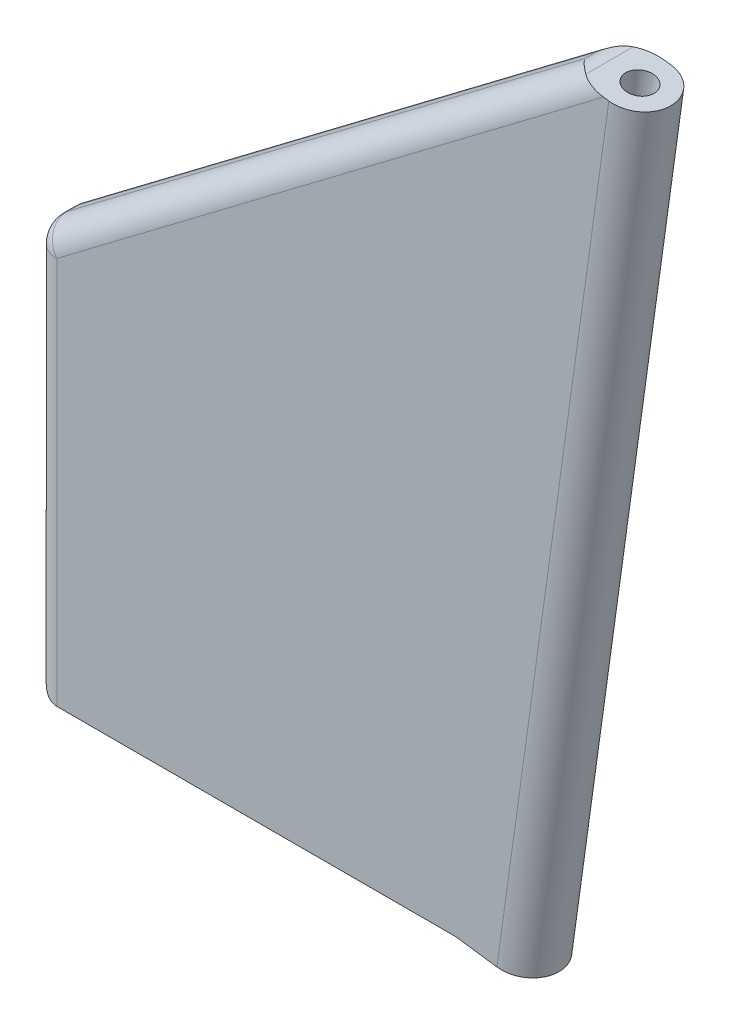
ISO-10303-21;
HEADER;
FILE_DESCRIPTION(('STEP AP214'),'2;1');
FILE_NAME('part.step','',(''),(''),'','','');
FILE_SCHEMA(('AUTOMOTIVE_DESIGN { 1 0 10303 214 1 1 1 1 }'));
ENDSEC;
DATA;
#1=APPLICATION_CONTEXT('core data for automotive mechanical design processes');
#2=APPLICATION_PROTOCOL_DEFINITION('international standard','automotive_design',2000,#1);
#3=PRODUCT_CONTEXT('',#1,'mechanical');
#4=PRODUCT('Part','Part','',(#3));
#5=PRODUCT_RELATED_PRODUCT_CATEGORY('part','',(#4));
#6=PRODUCT_DEFINITION_FORMATION('','',#4);
#7=PRODUCT_DEFINITION_CONTEXT('part definition',#1,'design');
#8=PRODUCT_DEFINITION('design','',#6,#7);
#9=PRODUCT_DEFINITION_SHAPE('','',#8);
#10=(LENGTH_UNIT() NAMED_UNIT(*) SI_UNIT(.MILLI.,.METRE.));
#11=(NAMED_UNIT(*) PLANE_ANGLE_UNIT() SI_UNIT($,.RADIAN.));
#12=(NAMED_UNIT(*) SI_UNIT($,.STERADIAN.) SOLID_ANGLE_UNIT());
#13=UNCERTAINTY_MEASURE_WITH_UNIT(LENGTH_MEASURE(1.E-05),#10,'distance_accuracy_value','');
#14=(GEOMETRIC_REPRESENTATION_CONTEXT(3) GLOBAL_UNCERTAINTY_ASSIGNED_CONTEXT((#13)) GLOBAL_UNIT_ASSIGNED_CONTEXT((#10,
#11,#12)) REPRESENTATION_CONTEXT('',''));
#15=CARTESIAN_POINT('',(0.,0.,0.));
#16=DIRECTION('',(0.,0.,1.));
#17=DIRECTION('',(1.,0.,0.));
#18=AXIS2_PLACEMENT_3D('',#15,#16,#17);
#19=CARTESIAN_POINT('',(14.053191707554,213.809429166406,0.));
#20=DIRECTION('',(-0.137573281939772,-0.990491591128527,0.));
#21=DIRECTION('',(0.990491591128527,-0.137573281939772,0.));
#22=AXIS2_PLACEMENT_3D('',#19,#20,#21);
#23=CYLINDRICAL_SURFACE('',#22,1.22499999999854);
#24=DIRECTION('',(-0.137573281939769,-0.990491591128527,0.));
#25=VECTOR('',#24,1.);
#26=CARTESIAN_POINT('',(-15.3475648523273,2.13168378755486,1.225));
#27=LINE('',#26,#25);
#28=CARTESIAN_POINT('',(13.4389513228232,209.387059303385,1.225));
#29=VERTEX_POINT('',#28);
#30=CARTESIAN_POINT('',(9.03660630075061,177.691328387272,1.225));
#31=VERTEX_POINT('',#30);
#32=EDGE_CURVE('E154',#29,#31,#27,.T.);
#33=ORIENTED_EDGE('',*,*,#32,.T.);
#34=CARTESIAN_POINT('',(9.03660630075059,177.691328387272,0.));
#35=DIRECTION('',(-0.137573281939772,-0.990491591128526,0.));
#36=DIRECTION('',(0.990491591128527,-0.137573281939772,0.));
#37=AXIS2_PLACEMENT_3D('',#34,#35,#36);
#38=CIRCLE('',#37,1.22499999999854);
#39=CARTESIAN_POINT('',(9.03660630075061,177.691328387272,-1.225));
#40=VERTEX_POINT('',#39);
#41=EDGE_CURVE('E150',#40,#31,#38,.T.);
#42=ORIENTED_EDGE('',*,*,#41,.F.);
#43=DIRECTION('',(-0.137573281939769,-0.990491591128527,0.));
#44=VECTOR('',#43,1.);
#45=CARTESIAN_POINT('',(-15.3475648523273,2.13168378755486,-1.225));
#46=LINE('',#45,#44);
#47=CARTESIAN_POINT('',(13.4389513228233,209.387059303385,-1.225));
#48=VERTEX_POINT('',#47);
#49=EDGE_CURVE('E167',#48,#40,#46,.T.);
#50=ORIENTED_EDGE('',*,*,#49,.F.);
#51=CARTESIAN_POINT('',(13.4389513228233,209.387059303385,0.));
#52=DIRECTION('',(0.13757328193977,0.990491591128527,0.));
#53=DIRECTION('',(-0.990491591128527,0.13757328193977,0.));
#54=AXIS2_PLACEMENT_3D('',#51,#52,#53);
#55=CIRCLE('',#54,1.22499999999854);
#56=EDGE_CURVE('E143',#48,#29,#55,.F.);
#57=ORIENTED_EDGE('',*,*,#56,.T.);
#58=EDGE_LOOP('',(#33,#42,#50,#57));
#59=FACE_BOUND('',#58,.T.);
#60=ADVANCED_FACE('F42',(#59),#23,.T.);
#61=CARTESIAN_POINT('',(14.053191707554,213.809429166406,0.));
#62=DIRECTION('',(-0.137573281939772,-0.990491591128527,0.));
#63=DIRECTION('',(0.990491591128527,-0.137573281939772,0.));
#64=AXIS2_PLACEMENT_3D('',#61,#62,#63);
#65=CYLINDRICAL_SURFACE('',#64,0.559999999998462);
#66=CARTESIAN_POINT('',(13.4389513228233,209.387059303385,0.));
#67=DIRECTION('',(0.13757328193977,0.990491591128527,0.));
#68=DIRECTION('',(-0.990491591128527,0.13757328193977,0.));
#69=AXIS2_PLACEMENT_3D('',#66,#67,#68);
#70=CIRCLE('',#69,0.559999999998462);
#71=CARTESIAN_POINT('',(12.8842760317928,209.464100341271,0.));
#72=VERTEX_POINT('',#71);
#73=EDGE_CURVE('E181',#72,#72,#70,.F.);
#74=ORIENTED_EDGE('',*,*,#73,.F.);
#75=EDGE_LOOP('',(#74));
#76=FACE_BOUND('',#75,.T.);
#77=CARTESIAN_POINT('',(9.03660630075059,177.691328387272,0.));
#78=DIRECTION('',(-0.137573281939772,-0.990491591128526,0.));
#79=DIRECTION('',(0.990491591128527,-0.137573281939772,0.));
#80=AXIS2_PLACEMENT_3D('',#77,#78,#79);
#81=CIRCLE('',#80,0.559999999998462);
#82=CARTESIAN_POINT('',(9.59128159178104,177.614287349386,0.));
#83=VERTEX_POINT('',#82);
#84=EDGE_CURVE('E182',#83,#83,#81,.T.);
#85=ORIENTED_EDGE('',*,*,#84,.T.);
#86=EDGE_LOOP('',(#85));
#87=FACE_BOUND('',#86,.T.);
#88=ADVANCED_FACE('F294',(#76,#87),#65,.F.);
#89=CARTESIAN_POINT('',(9.03660630075059,177.691328387272,0.));
#90=DIRECTION('',(-0.137573281939772,-0.990491591128526,0.));
#91=DIRECTION('',(0.990491591128527,-0.137573281939772,0.));
#92=AXIS2_PLACEMENT_3D('',#89,#90,#91);
#93=PLANE('',#92);
#94=ORIENTED_EDGE('',*,*,#84,.F.);
#95=EDGE_LOOP('',(#94));
#96=FACE_BOUND('',#95,.T.);
#97=ORIENTED_EDGE('',*,*,#41,.T.);
#98=DIRECTION('',(0.990491591128527,-0.137573281939769,0.));
#99=VECTOR('',#98,1.);
#100=CARTESIAN_POINT('',(24.3841711530779,175.559644599717,1.225));
#101=LINE('',#100,#99);
#102=CARTESIAN_POINT('',(7.42705746516676,177.914884970424,1.225));
#103=VERTEX_POINT('',#102);
#104=EDGE_CURVE('E147',#103,#31,#101,.T.);
#105=ORIENTED_EDGE('',*,*,#104,.F.);
#106=DIRECTION('',(0.,0.,-1.));
#107=VECTOR('',#106,1.);
#108=CARTESIAN_POINT('',(7.42705746516676,177.914884970424,1.225));
#109=LINE('',#108,#107);
#110=CARTESIAN_POINT('',(7.42705746516676,177.914884970424,-1.225));
#111=VERTEX_POINT('',#110);
#112=EDGE_CURVE('E134',#103,#111,#109,.T.);
#113=ORIENTED_EDGE('',*,*,#112,.T.);
#114=DIRECTION('',(0.990491591128527,-0.137573281939769,0.));
#115=VECTOR('',#114,1.);
#116=CARTESIAN_POINT('',(24.3841711530779,175.559644599717,-1.225));
#117=LINE('',#116,#115);
#118=EDGE_CURVE('E175',#111,#40,#117,.T.);
#119=ORIENTED_EDGE('',*,*,#118,.T.);
#120=EDGE_LOOP('',(#97,#105,#113,#119));
#121=FACE_BOUND('',#120,.T.);
#122=ADVANCED_FACE('F148',(#96,#121),#93,.T.);
#123=CARTESIAN_POINT('',(59.6599969718237,202.96723605443,18.1537181486117));
#124=DIRECTION('',(0.13757328193977,0.990491591128527,0.));
#125=DIRECTION('',(-0.923100591205918,0.128213080282738,-0.362555795098763));
#126=AXIS2_PLACEMENT_3D('',#123,#124,#125);
#127=PLANE('',#126);
#128=ORIENTED_EDGE('',*,*,#73,.T.);
#129=EDGE_LOOP('',(#128));
#130=FACE_BOUND('',#129,.T.);
#131=DIRECTION('',(0.,0.,-1.));
#132=VECTOR('',#131,1.);
#133=CARTESIAN_POINT('',(12.2395106808873,209.553654342738,18.1537181486118));
#134=LINE('',#133,#132);
#135=CARTESIAN_POINT('',(12.2395106808872,209.553654342738,-0.931903392333362));
#136=VERTEX_POINT('',#135);
#137=CARTESIAN_POINT('',(12.2395106808872,209.553654342738,0.931903392333362));
#138=VERTEX_POINT('',#137);
#139=EDGE_CURVE('E52',#136,#138,#134,.F.);
#140=ORIENTED_EDGE('',*,*,#139,.T.);
#141=CARTESIAN_POINT('',(13.2305721546519,209.416001907552,0.225));
#142=DIRECTION('',(0.13757328193977,0.990491591128527,0.));
#143=DIRECTION('',(0.990491591128527,-0.13757328193977,0.));
#144=AXIS2_PLACEMENT_3D('',#141,#142,#143);
#145=ELLIPSE('',#144,1.41462045711679,1.);
#146=CARTESIAN_POINT('',(13.2305721546518,209.416001907552,1.225));
#147=VERTEX_POINT('',#146);
#148=EDGE_CURVE('E12',#138,#147,#145,.T.);
#149=ORIENTED_EDGE('',*,*,#148,.T.);
#150=DIRECTION('',(0.990491591128526,-0.137573281939777,0.));
#151=VECTOR('',#150,1.);
#152=CARTESIAN_POINT('',(28.7865161751523,207.255375515829,1.225));
#153=LINE('',#152,#151);
#154=EDGE_CURVE('E144',#147,#29,#153,.T.);
#155=ORIENTED_EDGE('',*,*,#154,.T.);
#156=ORIENTED_EDGE('',*,*,#56,.F.);
#157=DIRECTION('',(0.990491591128526,-0.137573281939777,0.));
#158=VECTOR('',#157,1.);
#159=CARTESIAN_POINT('',(28.7865161751523,207.255375515829,-1.225));
#160=LINE('',#159,#158);
#161=CARTESIAN_POINT('',(13.2305721546518,209.416001907552,-1.225));
#162=VERTEX_POINT('',#161);
#163=EDGE_CURVE('E161',#162,#48,#160,.T.);
#164=ORIENTED_EDGE('',*,*,#163,.F.);
#165=CARTESIAN_POINT('',(13.2305721546519,209.416001907552,-0.225));
#166=DIRECTION('',(0.13757328193977,0.990491591128527,0.));
#167=DIRECTION('',(-0.990491591128527,0.13757328193977,0.));
#168=AXIS2_PLACEMENT_3D('',#165,#166,#167);
#169=ELLIPSE('',#168,1.41462045711679,1.);
#170=EDGE_CURVE('E69',#162,#136,#169,.T.);
#171=ORIENTED_EDGE('',*,*,#170,.T.);
#172=EDGE_LOOP('',(#140,#149,#155,#156,#164,#171));
#173=FACE_BOUND('',#172,.T.);
#174=ADVANCED_FACE('F304',(#130,#173),#127,.T.);
#175=CARTESIAN_POINT('',(-96.5221937923368,127.736047121869,1.225));
#176=DIRECTION('',(-0.602874892450628,0.797835737512831,0.));
#177=DIRECTION('',(-0.797835737512831,-0.602874892450628,0.));
#178=AXIS2_PLACEMENT_3D('',#175,#176,#177);
#179=PLANE('',#178);
#180=DIRECTION('',(0.797835737512831,0.602874892450628,0.));
#181=VECTOR('',#180,1.);
#182=CARTESIAN_POINT('',(-96.5221937923368,127.736047121869,0.225));
#183=LINE('',#182,#181);
#184=CARTESIAN_POINT('',(-8.87581742728386,193.9649677384,0.225));
#185=VERTEX_POINT('',#184);
#186=CARTESIAN_POINT('',(11.4990625064968,209.360998489122,0.225));
#187=VERTEX_POINT('',#186);
#188=EDGE_CURVE('E216',#185,#187,#183,.T.);
#189=ORIENTED_EDGE('',*,*,#188,.T.);
#190=DIRECTION('',(0.,0.,-1.));
#191=VECTOR('',#190,1.);
#192=CARTESIAN_POINT('',(11.4990625064968,209.360998489122,1.2249999999994));
#193=LINE('',#192,#191);
#194=CARTESIAN_POINT('',(11.4990625064968,209.360998489122,-0.225));
#195=VERTEX_POINT('',#194);
#196=EDGE_CURVE('E219',#187,#195,#193,.T.);
#197=ORIENTED_EDGE('',*,*,#196,.T.);
#198=DIRECTION('',(0.797835737512831,0.602874892450628,0.));
#199=VECTOR('',#198,1.);
#200=CARTESIAN_POINT('',(-9.27294253483323,193.664884970424,-0.225));
#201=LINE('',#200,#199);
#202=CARTESIAN_POINT('',(-8.87581742728386,193.9649677384,-0.225));
#203=VERTEX_POINT('',#202);
#204=EDGE_CURVE('E211',#195,#203,#201,.F.);
#205=ORIENTED_EDGE('',*,*,#204,.T.);
#206=DIRECTION('',(0.,0.,-1.));
#207=VECTOR('',#206,1.);
#208=CARTESIAN_POINT('',(-8.87581742728387,193.9649677384,1.225));
#209=LINE('',#208,#207);
#210=EDGE_CURVE('E214',#203,#185,#209,.F.);
#211=ORIENTED_EDGE('',*,*,#210,.T.);
#212=EDGE_LOOP('',(#189,#197,#205,#211));
#213=FACE_BOUND('',#212,.T.);
#214=ADVANCED_FACE('F279',(#213),#179,.T.);
#215=CARTESIAN_POINT('',(-9.27294253483324,0.,1.225));
#216=DIRECTION('',(-1.,0.,0.));
#217=DIRECTION('',(0.,0.,1.));
#218=AXIS2_PLACEMENT_3D('',#215,#216,#217);
#219=PLANE('',#218);
#220=DIRECTION('',(0.,0.,-1.));
#221=VECTOR('',#220,1.);
#222=CARTESIAN_POINT('',(-9.27294253483324,178.914884970424,1.225));
#223=LINE('',#222,#221);
#224=CARTESIAN_POINT('',(-9.27294253483324,178.914884970424,-0.225));
#225=VERTEX_POINT('',#224);
#226=CARTESIAN_POINT('',(-9.27294253483324,178.914884970424,0.225));
#227=VERTEX_POINT('',#226);
#228=EDGE_CURVE('E195',#225,#227,#223,.F.);
#229=ORIENTED_EDGE('',*,*,#228,.T.);
#230=DIRECTION('',(0.,1.,0.));
#231=VECTOR('',#230,1.);
#232=CARTESIAN_POINT('',(-9.27294253483324,0.,0.225));
#233=LINE('',#232,#231);
#234=CARTESIAN_POINT('',(-9.27294253483324,193.167132000887,0.225));
#235=VERTEX_POINT('',#234);
#236=EDGE_CURVE('E197',#227,#235,#233,.T.);
#237=ORIENTED_EDGE('',*,*,#236,.T.);
#238=DIRECTION('',(0.,0.,-1.));
#239=VECTOR('',#238,1.);
#240=CARTESIAN_POINT('',(-9.27294253483324,193.167132000887,1.225));
#241=LINE('',#240,#239);
#242=CARTESIAN_POINT('',(-9.27294253483324,193.167132000887,-0.225));
#243=VERTEX_POINT('',#242);
#244=EDGE_CURVE('E188',#235,#243,#241,.T.);
#245=ORIENTED_EDGE('',*,*,#244,.T.);
#246=DIRECTION('',(0.,1.,0.));
#247=VECTOR('',#246,1.);
#248=CARTESIAN_POINT('',(-9.27294253483324,177.914884970424,-0.225));
#249=LINE('',#248,#247);
#250=EDGE_CURVE('E193',#243,#225,#249,.F.);
#251=ORIENTED_EDGE('',*,*,#250,.T.);
#252=EDGE_LOOP('',(#229,#237,#245,#251));
#253=FACE_BOUND('',#252,.T.);
#254=ADVANCED_FACE('F270',(#253),#219,.T.);
#255=CARTESIAN_POINT('',(0.,177.914884970424,1.225));
#256=DIRECTION('',(0.,-1.,0.));
#257=DIRECTION('',(0.,0.,-1.));
#258=AXIS2_PLACEMENT_3D('',#255,#256,#257);
#259=PLANE('',#258);
#260=DIRECTION('',(-1.,0.,0.));
#261=VECTOR('',#260,1.);
#262=CARTESIAN_POINT('',(0.,177.914884970424,1.225));
#263=LINE('',#262,#261);
#264=CARTESIAN_POINT('',(-8.27294253483324,177.914884970424,1.225));
#265=VERTEX_POINT('',#264);
#266=EDGE_CURVE('E138',#103,#265,#263,.T.);
#267=ORIENTED_EDGE('',*,*,#266,.T.);
#268=DIRECTION('',(0.,0.,-1.));
#269=VECTOR('',#268,1.);
#270=CARTESIAN_POINT('',(-8.27294253483324,177.914884970424,1.225));
#271=LINE('',#270,#269);
#272=CARTESIAN_POINT('',(-8.27294253483324,177.914884970424,-1.225));
#273=VERTEX_POINT('',#272);
#274=EDGE_CURVE('E204',#265,#273,#271,.T.);
#275=ORIENTED_EDGE('',*,*,#274,.T.);
#276=DIRECTION('',(-1.,0.,0.));
#277=VECTOR('',#276,1.);
#278=CARTESIAN_POINT('',(0.,177.914884970424,-1.225));
#279=LINE('',#278,#277);
#280=EDGE_CURVE('E140',#111,#273,#279,.T.);
#281=ORIENTED_EDGE('',*,*,#280,.F.);
#282=ORIENTED_EDGE('',*,*,#112,.F.);
#283=EDGE_LOOP('',(#267,#275,#281,#282));
#284=FACE_BOUND('',#283,.T.);
#285=ADVANCED_FACE('F136',(#284),#259,.T.);
#286=CARTESIAN_POINT('',(0.,0.,1.225));
#287=DIRECTION('',(0.,0.,1.));
#288=DIRECTION('',(1.,0.,0.));
#289=AXIS2_PLACEMENT_3D('',#286,#287,#288);
#290=PLANE('',#289);
#291=DIRECTION('',(0.797835737512831,0.602874892450628,0.));
#292=VECTOR('',#291,1.);
#293=CARTESIAN_POINT('',(-95.9193188998862,126.938211384357,1.225));
#294=LINE('',#293,#292);
#295=CARTESIAN_POINT('',(-8.27294253483323,193.167132000887,1.225));
#296=VERTEX_POINT('',#295);
#297=EDGE_CURVE('E200',#147,#296,#294,.F.);
#298=ORIENTED_EDGE('',*,*,#297,.T.);
#299=DIRECTION('',(0.,1.,0.));
#300=VECTOR('',#299,1.);
#301=CARTESIAN_POINT('',(-8.27294253483324,0.,1.225));
#302=LINE('',#301,#300);
#303=EDGE_CURVE('E159',#296,#265,#302,.F.);
#304=ORIENTED_EDGE('',*,*,#303,.T.);
#305=ORIENTED_EDGE('',*,*,#266,.F.);
#306=ORIENTED_EDGE('',*,*,#104,.T.);
#307=ORIENTED_EDGE('',*,*,#32,.F.);
#308=ORIENTED_EDGE('',*,*,#154,.F.);
#309=EDGE_LOOP('',(#298,#304,#305,#306,#307,#308));
#310=FACE_BOUND('',#309,.T.);
#311=ADVANCED_FACE('F157',(#310),#290,.T.);
#312=CARTESIAN_POINT('',(0.,0.,-1.225));
#313=DIRECTION('',(0.,0.,1.));
#314=DIRECTION('',(1.,0.,0.));
#315=AXIS2_PLACEMENT_3D('',#312,#313,#314);
#316=PLANE('',#315);
#317=ORIENTED_EDGE('',*,*,#280,.T.);
#318=DIRECTION('',(0.,1.,0.));
#319=VECTOR('',#318,1.);
#320=CARTESIAN_POINT('',(-8.27294253483324,193.664884970424,-1.225));
#321=LINE('',#320,#319);
#322=CARTESIAN_POINT('',(-8.27294253483324,193.167132000887,-1.225));
#323=VERTEX_POINT('',#322);
#324=EDGE_CURVE('E208',#273,#323,#321,.T.);
#325=ORIENTED_EDGE('',*,*,#324,.T.);
#326=DIRECTION('',(0.797835737512831,0.602874892450628,0.));
#327=VECTOR('',#326,1.);
#328=CARTESIAN_POINT('',(12.43227737969,208.812780149024,-1.225));
#329=LINE('',#328,#327);
#330=EDGE_CURVE('E206',#323,#162,#329,.T.);
#331=ORIENTED_EDGE('',*,*,#330,.T.);
#332=ORIENTED_EDGE('',*,*,#163,.T.);
#333=ORIENTED_EDGE('',*,*,#49,.T.);
#334=ORIENTED_EDGE('',*,*,#118,.F.);
#335=EDGE_LOOP('',(#317,#325,#331,#332,#333,#334));
#336=FACE_BOUND('',#335,.T.);
#337=ADVANCED_FACE('F374',(#336),#316,.F.);
#338=CARTESIAN_POINT('',(-95.9193188998862,126.938211384357,-0.225));
#339=DIRECTION('',(-0.797835737512831,-0.602874892450628,0.));
#340=DIRECTION('',(0.602874892450628,-0.797835737512831,0.));
#341=AXIS2_PLACEMENT_3D('',#338,#339,#340);
#342=CYLINDRICAL_SURFACE('',#341,1.);
#343=CARTESIAN_POINT('',(-8.27294253483324,193.167132000887,-0.225));
#344=DIRECTION('',(-0.797835737512829,-0.602874892450631,0.));
#345=DIRECTION('',(0.602874892450632,-0.797835737512829,0.));
#346=AXIS2_PLACEMENT_3D('',#343,#344,#345);
#347=CIRCLE('',#346,1.);
#348=EDGE_CURVE('E46',#203,#323,#347,.T.);
#349=ORIENTED_EDGE('',*,*,#348,.F.);
#350=ORIENTED_EDGE('',*,*,#204,.F.);
#351=CARTESIAN_POINT('',(12.1019373989474,208.563162751609,-0.225));
#352=DIRECTION('',(-0.564155060268295,-0.426296924658951,-0.707106781186546));
#353=DIRECTION('',(-0.564155060268292,-0.426296924658949,0.707106781186549));
#354=AXIS2_PLACEMENT_3D('',#351,#352,#353);
#355=ELLIPSE('',#354,1.41421356237309,1.);
#356=EDGE_CURVE('E249',#136,#195,#355,.F.);
#357=ORIENTED_EDGE('',*,*,#356,.F.);
#358=ORIENTED_EDGE('',*,*,#170,.F.);
#359=ORIENTED_EDGE('',*,*,#330,.F.);
#360=EDGE_LOOP('',(#349,#350,#357,#358,#359));
#361=FACE_BOUND('',#360,.T.);
#362=ADVANCED_FACE('F44',(#361),#342,.T.);
#363=CARTESIAN_POINT('',(-8.27294253483324,193.167132000887,-0.225));
#364=DIRECTION('',(0.,0.,1.));
#365=DIRECTION('',(1.,0.,0.));
#366=AXIS2_PLACEMENT_3D('',#363,#364,#365);
#367=SPHERICAL_SURFACE('',#366,1.);
#368=CARTESIAN_POINT('',(-8.27294253483324,193.167132000887,-0.225));
#369=DIRECTION('',(0.,0.,-1.));
#370=DIRECTION('',(-1.,0.,0.));
#371=AXIS2_PLACEMENT_3D('',#368,#369,#370);
#372=CIRCLE('',#371,1.);
#373=EDGE_CURVE('E244',#203,#243,#372,.F.);
#374=ORIENTED_EDGE('',*,*,#373,.F.);
#375=ORIENTED_EDGE('',*,*,#348,.T.);
#376=CARTESIAN_POINT('',(-8.27294253483324,193.167132000887,-0.225));
#377=DIRECTION('',(0.,1.,0.));
#378=DIRECTION('',(0.,0.,1.));
#379=AXIS2_PLACEMENT_3D('',#376,#377,#378);
#380=CIRCLE('',#379,1.);
#381=EDGE_CURVE('E247',#243,#323,#380,.F.);
#382=ORIENTED_EDGE('',*,*,#381,.F.);
#383=EDGE_LOOP('',(#374,#375,#382));
#384=FACE_BOUND('',#383,.T.);
#385=ADVANCED_FACE('F259',(#384),#367,.T.);
#386=CARTESIAN_POINT('',(12.1019373989474,208.563162751609,1.2249999999994));
#387=DIRECTION('',(0.,0.,-1.));
#388=DIRECTION('',(-1.,0.,0.));
#389=AXIS2_PLACEMENT_3D('',#386,#387,#388);
#390=CYLINDRICAL_SURFACE('',#389,1.);
#391=ORIENTED_EDGE('',*,*,#356,.T.);
#392=ORIENTED_EDGE('',*,*,#196,.F.);
#393=CARTESIAN_POINT('',(12.1019373989474,208.563162751609,0.225));
#394=DIRECTION('',(0.564155060268292,0.426296924658949,-0.707106781186549));
#395=DIRECTION('',(0.564155060268295,0.426296924658951,0.707106781186546));
#396=AXIS2_PLACEMENT_3D('',#393,#394,#395);
#397=ELLIPSE('',#396,1.4142135623731,1.);
#398=EDGE_CURVE('E240',#138,#187,#397,.F.);
#399=ORIENTED_EDGE('',*,*,#398,.F.);
#400=ORIENTED_EDGE('',*,*,#139,.F.);
#401=EDGE_LOOP('',(#391,#392,#399,#400));
#402=FACE_BOUND('',#401,.T.);
#403=ADVANCED_FACE('F285',(#402),#390,.T.);
#404=CARTESIAN_POINT('',(-8.27294253483324,0.,-0.225));
#405=DIRECTION('',(0.,-1.,0.));
#406=DIRECTION('',(0.,0.,-1.));
#407=AXIS2_PLACEMENT_3D('',#404,#405,#406);
#408=CYLINDRICAL_SURFACE('',#407,1.);
#409=ORIENTED_EDGE('',*,*,#381,.T.);
#410=ORIENTED_EDGE('',*,*,#324,.F.);
#411=CARTESIAN_POINT('',(-8.27294253483324,178.914884970424,-0.225));
#412=DIRECTION('',(0.,-0.707106781186547,0.707106781186547));
#413=DIRECTION('',(0.,-0.707106781186547,-0.707106781186547));
#414=AXIS2_PLACEMENT_3D('',#411,#412,#413);
#415=ELLIPSE('',#414,1.41421356237309,1.);
#416=EDGE_CURVE('E237',#225,#273,#415,.T.);
#417=ORIENTED_EDGE('',*,*,#416,.F.);
#418=ORIENTED_EDGE('',*,*,#250,.F.);
#419=EDGE_LOOP('',(#409,#410,#417,#418));
#420=FACE_BOUND('',#419,.T.);
#421=ADVANCED_FACE('F266',(#420),#408,.T.);
#422=CARTESIAN_POINT('',(-8.27294253483324,193.167132000887,1.225));
#423=DIRECTION('',(0.,0.,-1.));
#424=DIRECTION('',(-1.,0.,0.));
#425=AXIS2_PLACEMENT_3D('',#422,#423,#424);
#426=CYLINDRICAL_SURFACE('',#425,1.);
#427=ORIENTED_EDGE('',*,*,#373,.T.);
#428=ORIENTED_EDGE('',*,*,#244,.F.);
#429=CARTESIAN_POINT('',(-8.27294253483324,193.167132000887,0.225));
#430=DIRECTION('',(0.,0.,1.));
#431=DIRECTION('',(1.,0.,0.));
#432=AXIS2_PLACEMENT_3D('',#429,#430,#431);
#433=CIRCLE('',#432,1.);
#434=EDGE_CURVE('E234',#185,#235,#433,.T.);
#435=ORIENTED_EDGE('',*,*,#434,.F.);
#436=ORIENTED_EDGE('',*,*,#210,.F.);
#437=EDGE_LOOP('',(#427,#428,#435,#436));
#438=FACE_BOUND('',#437,.T.);
#439=ADVANCED_FACE('F276',(#438),#426,.T.);
#440=CARTESIAN_POINT('',(-95.9193188998862,126.938211384357,0.225));
#441=DIRECTION('',(0.797835737512831,0.602874892450628,0.));
#442=DIRECTION('',(-0.602874892450628,0.797835737512831,0.));
#443=AXIS2_PLACEMENT_3D('',#440,#441,#442);
#444=CYLINDRICAL_SURFACE('',#443,1.);
#445=ORIENTED_EDGE('',*,*,#398,.T.);
#446=ORIENTED_EDGE('',*,*,#188,.F.);
#447=CARTESIAN_POINT('',(-8.27294253483323,193.167132000887,0.225));
#448=DIRECTION('',(-0.797835737512827,-0.602874892450634,0.));
#449=DIRECTION('',(0.602874892450634,-0.797835737512827,0.));
#450=AXIS2_PLACEMENT_3D('',#447,#448,#449);
#451=CIRCLE('',#450,1.);
#452=EDGE_CURVE('E231',#296,#185,#451,.T.);
#453=ORIENTED_EDGE('',*,*,#452,.F.);
#454=ORIENTED_EDGE('',*,*,#297,.F.);
#455=ORIENTED_EDGE('',*,*,#148,.F.);
#456=EDGE_LOOP('',(#445,#446,#453,#454,#455));
#457=FACE_BOUND('',#456,.T.);
#458=ADVANCED_FACE('F282',(#457),#444,.T.);
#459=CARTESIAN_POINT('',(-8.27294253483324,178.914884970424,1.225));
#460=DIRECTION('',(0.,0.,-1.));
#461=DIRECTION('',(-1.,0.,0.));
#462=AXIS2_PLACEMENT_3D('',#459,#460,#461);
#463=CYLINDRICAL_SURFACE('',#462,1.);
#464=ORIENTED_EDGE('',*,*,#416,.T.);
#465=ORIENTED_EDGE('',*,*,#274,.F.);
#466=CARTESIAN_POINT('',(-8.27294253483324,178.914884970424,0.225));
#467=DIRECTION('',(0.,-0.707106781186547,-0.707106781186547));
#468=DIRECTION('',(0.,0.707106781186547,-0.707106781186547));
#469=AXIS2_PLACEMENT_3D('',#466,#467,#468);
#470=ELLIPSE('',#469,1.41421356237309,1.);
#471=EDGE_CURVE('E229',#227,#265,#470,.F.);
#472=ORIENTED_EDGE('',*,*,#471,.F.);
#473=ORIENTED_EDGE('',*,*,#228,.F.);
#474=EDGE_LOOP('',(#464,#465,#472,#473));
#475=FACE_BOUND('',#474,.T.);
#476=ADVANCED_FACE('F315',(#475),#463,.T.);
#477=CARTESIAN_POINT('',(-8.27294253483324,193.167132000887,0.225));
#478=DIRECTION('',(0.,0.,1.));
#479=DIRECTION('',(1.,0.,0.));
#480=AXIS2_PLACEMENT_3D('',#477,#478,#479);
#481=SPHERICAL_SURFACE('',#480,1.);
#482=ORIENTED_EDGE('',*,*,#452,.T.);
#483=ORIENTED_EDGE('',*,*,#434,.T.);
#484=CARTESIAN_POINT('',(-8.27294253483324,193.167132000887,0.225));
#485=DIRECTION('',(0.,1.,0.));
#486=DIRECTION('',(0.,0.,1.));
#487=AXIS2_PLACEMENT_3D('',#484,#485,#486);
#488=CIRCLE('',#487,1.);
#489=EDGE_CURVE('E227',#296,#235,#488,.F.);
#490=ORIENTED_EDGE('',*,*,#489,.F.);
#491=EDGE_LOOP('',(#482,#483,#490));
#492=FACE_BOUND('',#491,.T.);
#493=ADVANCED_FACE('F311',(#492),#481,.T.);
#494=CARTESIAN_POINT('',(-8.27294253483324,0.,0.225));
#495=DIRECTION('',(0.,1.,0.));
#496=DIRECTION('',(0.,0.,1.));
#497=AXIS2_PLACEMENT_3D('',#494,#495,#496);
#498=CYLINDRICAL_SURFACE('',#497,1.);
#499=ORIENTED_EDGE('',*,*,#471,.T.);
#500=ORIENTED_EDGE('',*,*,#303,.F.);
#501=ORIENTED_EDGE('',*,*,#489,.T.);
#502=ORIENTED_EDGE('',*,*,#236,.F.);
#503=EDGE_LOOP('',(#499,#500,#501,#502));
#504=FACE_BOUND('',#503,.T.);
#505=ADVANCED_FACE('F308',(#504),#498,.T.);
#506=CLOSED_SHELL('',(#60,#88,#122,#174,#214,#254,#285,#311,#337,#362,#385,#403,#421,#439,#458,
#476,#493,#505));
#507=MANIFOLD_SOLID_BREP('B2',#506);
#508=ADVANCED_BREP_SHAPE_REPRESENTATION('',(#18,#507),#14);
#509=SHAPE_DEFINITION_REPRESENTATION(#9,#508);
ENDSEC;
END-ISO-10303-21;
